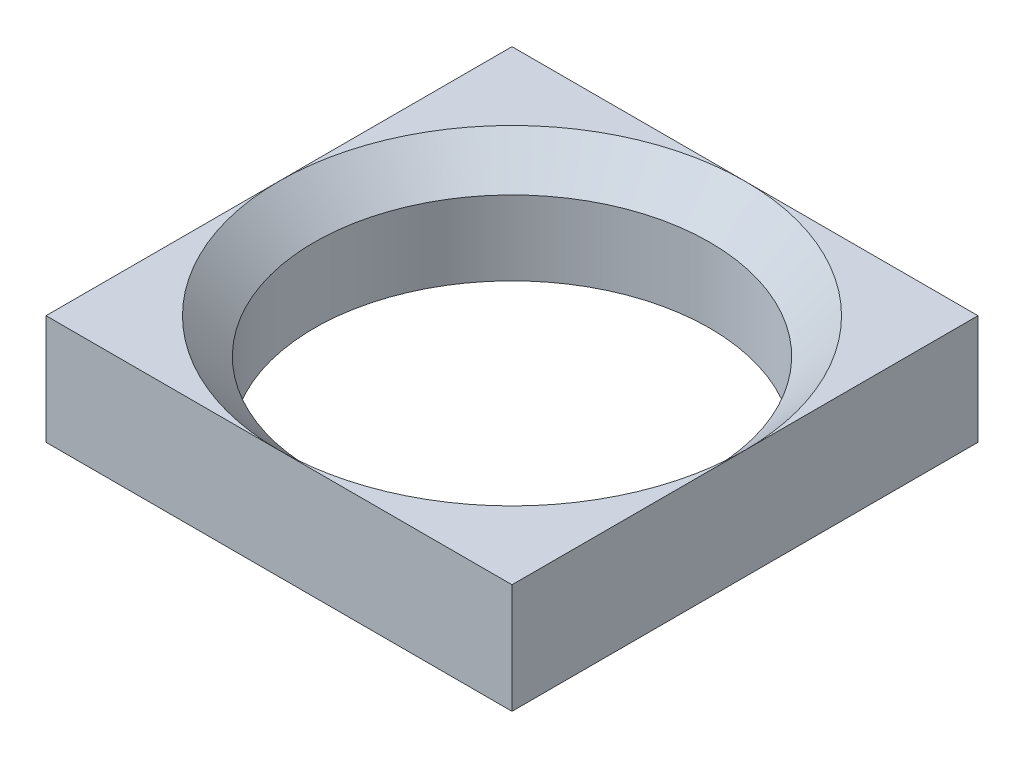
ISO-10303-21;
HEADER;
FILE_DESCRIPTION(('STEP AP214'),'2;1');
FILE_NAME('part.step','',(''),(''),'','','');
FILE_SCHEMA(('AUTOMOTIVE_DESIGN { 1 0 10303 214 1 1 1 1 }'));
ENDSEC;
DATA;
#1=APPLICATION_CONTEXT('core data for automotive mechanical design processes');
#2=APPLICATION_PROTOCOL_DEFINITION('international standard','automotive_design',2000,#1);
#3=PRODUCT_CONTEXT('',#1,'mechanical');
#4=PRODUCT('Part','Part','',(#3));
#5=PRODUCT_RELATED_PRODUCT_CATEGORY('part','',(#4));
#6=PRODUCT_DEFINITION_FORMATION('','',#4);
#7=PRODUCT_DEFINITION_CONTEXT('part definition',#1,'design');
#8=PRODUCT_DEFINITION('design','',#6,#7);
#9=PRODUCT_DEFINITION_SHAPE('','',#8);
#10=(LENGTH_UNIT() NAMED_UNIT(*) SI_UNIT(.MILLI.,.METRE.));
#11=(NAMED_UNIT(*) PLANE_ANGLE_UNIT() SI_UNIT($,.RADIAN.));
#12=(NAMED_UNIT(*) SI_UNIT($,.STERADIAN.) SOLID_ANGLE_UNIT());
#13=UNCERTAINTY_MEASURE_WITH_UNIT(LENGTH_MEASURE(1.E-05),#10,'distance_accuracy_value','');
#14=(GEOMETRIC_REPRESENTATION_CONTEXT(3) GLOBAL_UNCERTAINTY_ASSIGNED_CONTEXT((#13)) GLOBAL_UNIT_ASSIGNED_CONTEXT((#10,
#11,#12)) REPRESENTATION_CONTEXT('',''));
#15=CARTESIAN_POINT('',(0.,0.,0.));
#16=DIRECTION('',(0.,0.,1.));
#17=DIRECTION('',(1.,0.,0.));
#18=AXIS2_PLACEMENT_3D('',#15,#16,#17);
#19=CARTESIAN_POINT('',(0.,2.8,0.));
#20=DIRECTION('',(0.,1.,0.));
#21=DIRECTION('',(0.,0.,1.));
#22=AXIS2_PLACEMENT_3D('',#19,#20,#21);
#23=PLANE('',#22);
#24=DIRECTION('',(1.,0.,0.));
#25=VECTOR('',#24,1.);
#26=CARTESIAN_POINT('',(-5.95,2.8,5.95));
#27=LINE('',#26,#25);
#28=CARTESIAN_POINT('',(-5.95,2.8,5.95));
#29=VERTEX_POINT('',#28);
#30=CARTESIAN_POINT('',(0.,2.8,5.95));
#31=VERTEX_POINT('',#30);
#32=EDGE_CURVE('E142',#29,#31,#27,.T.);
#33=ORIENTED_EDGE('',*,*,#32,.T.);
#34=CARTESIAN_POINT('',(0.,2.8,0.));
#35=DIRECTION('',(0.,1.,0.));
#36=DIRECTION('',(0.,0.,1.));
#37=AXIS2_PLACEMENT_3D('',#34,#35,#36);
#38=CIRCLE('',#37,5.95000000000001);
#39=CARTESIAN_POINT('',(-5.95,2.8,0.));
#40=VERTEX_POINT('',#39);
#41=EDGE_CURVE('E11',#31,#40,#38,.F.);
#42=ORIENTED_EDGE('',*,*,#41,.T.);
#43=DIRECTION('',(0.,0.,1.));
#44=VECTOR('',#43,1.);
#45=CARTESIAN_POINT('',(-5.95,2.8,-5.95));
#46=LINE('',#45,#44);
#47=EDGE_CURVE('E116',#40,#29,#46,.T.);
#48=ORIENTED_EDGE('',*,*,#47,.T.);
#49=EDGE_LOOP('',(#33,#42,#48));
#50=FACE_BOUND('',#49,.T.);
#51=ADVANCED_FACE('F43',(#50),#23,.T.);
#52=CARTESIAN_POINT('',(-5.95,2.8,-5.95));
#53=VERTEX_POINT('',#52);
#54=EDGE_CURVE('E137',#53,#40,#46,.T.);
#55=ORIENTED_EDGE('',*,*,#54,.T.);
#56=CARTESIAN_POINT('',(0.,2.8,0.));
#57=DIRECTION('',(0.,1.,0.));
#58=DIRECTION('',(0.,0.,1.));
#59=AXIS2_PLACEMENT_3D('',#56,#57,#58);
#60=CIRCLE('',#59,5.95000000000001);
#61=CARTESIAN_POINT('',(0.,2.8,-5.95));
#62=VERTEX_POINT('',#61);
#63=EDGE_CURVE('E52',#40,#62,#60,.F.);
#64=ORIENTED_EDGE('',*,*,#63,.T.);
#65=DIRECTION('',(-1.,0.,0.));
#66=VECTOR('',#65,1.);
#67=CARTESIAN_POINT('',(-5.95,2.8,-5.95));
#68=LINE('',#67,#66);
#69=EDGE_CURVE('E115',#62,#53,#68,.T.);
#70=ORIENTED_EDGE('',*,*,#69,.T.);
#71=EDGE_LOOP('',(#55,#64,#70));
#72=FACE_BOUND('',#71,.T.);
#73=ADVANCED_FACE('F135',(#72),#23,.T.);
#74=CARTESIAN_POINT('',(5.95,2.8,-5.95));
#75=VERTEX_POINT('',#74);
#76=EDGE_CURVE('E100',#75,#62,#68,.T.);
#77=ORIENTED_EDGE('',*,*,#76,.T.);
#78=CARTESIAN_POINT('',(0.,2.8,0.));
#79=DIRECTION('',(0.,1.,0.));
#80=DIRECTION('',(0.,0.,1.));
#81=AXIS2_PLACEMENT_3D('',#78,#79,#80);
#82=CIRCLE('',#81,5.95000000000001);
#83=CARTESIAN_POINT('',(5.95,2.8,0.));
#84=VERTEX_POINT('',#83);
#85=EDGE_CURVE('E101',#62,#84,#82,.F.);
#86=ORIENTED_EDGE('',*,*,#85,.T.);
#87=DIRECTION('',(0.,0.,-1.));
#88=VECTOR('',#87,1.);
#89=CARTESIAN_POINT('',(5.95,2.8,-5.95));
#90=LINE('',#89,#88);
#91=EDGE_CURVE('E97',#84,#75,#90,.T.);
#92=ORIENTED_EDGE('',*,*,#91,.T.);
#93=EDGE_LOOP('',(#77,#86,#92));
#94=FACE_BOUND('',#93,.T.);
#95=ADVANCED_FACE('F99',(#94),#23,.T.);
#96=CARTESIAN_POINT('',(5.95,2.8,5.95));
#97=VERTEX_POINT('',#96);
#98=EDGE_CURVE('E105',#97,#84,#90,.T.);
#99=ORIENTED_EDGE('',*,*,#98,.T.);
#100=CARTESIAN_POINT('',(0.,2.8,0.));
#101=DIRECTION('',(0.,1.,0.));
#102=DIRECTION('',(0.,0.,1.));
#103=AXIS2_PLACEMENT_3D('',#100,#101,#102);
#104=CIRCLE('',#103,5.95000000000001);
#105=EDGE_CURVE('E59',#84,#31,#104,.F.);
#106=ORIENTED_EDGE('',*,*,#105,.T.);
#107=EDGE_CURVE('E140',#31,#97,#27,.T.);
#108=ORIENTED_EDGE('',*,*,#107,.T.);
#109=EDGE_LOOP('',(#99,#106,#108));
#110=FACE_BOUND('',#109,.T.);
#111=ADVANCED_FACE('F178',(#110),#23,.T.);
#112=CARTESIAN_POINT('',(0.,0.,0.));
#113=DIRECTION('',(0.,1.,0.));
#114=DIRECTION('',(0.,0.,1.));
#115=AXIS2_PLACEMENT_3D('',#112,#113,#114);
#116=PLANE('',#115);
#117=DIRECTION('',(0.,0.,-1.));
#118=VECTOR('',#117,1.);
#119=CARTESIAN_POINT('',(5.95,0.,-5.95));
#120=LINE('',#119,#118);
#121=CARTESIAN_POINT('',(5.95,0.,5.95));
#122=VERTEX_POINT('',#121);
#123=CARTESIAN_POINT('',(5.95,0.,-5.95));
#124=VERTEX_POINT('',#123);
#125=EDGE_CURVE('E121',#122,#124,#120,.T.);
#126=ORIENTED_EDGE('',*,*,#125,.F.);
#127=DIRECTION('',(1.,0.,0.));
#128=VECTOR('',#127,1.);
#129=CARTESIAN_POINT('',(-5.95,0.,5.95));
#130=LINE('',#129,#128);
#131=CARTESIAN_POINT('',(-5.95,0.,5.95));
#132=VERTEX_POINT('',#131);
#133=EDGE_CURVE('E106',#132,#122,#130,.T.);
#134=ORIENTED_EDGE('',*,*,#133,.F.);
#135=DIRECTION('',(0.,0.,1.));
#136=VECTOR('',#135,1.);
#137=CARTESIAN_POINT('',(-5.95,0.,-5.95));
#138=LINE('',#137,#136);
#139=CARTESIAN_POINT('',(-5.95,0.,-5.95));
#140=VERTEX_POINT('',#139);
#141=EDGE_CURVE('E151',#140,#132,#138,.T.);
#142=ORIENTED_EDGE('',*,*,#141,.F.);
#143=DIRECTION('',(-1.,0.,0.));
#144=VECTOR('',#143,1.);
#145=CARTESIAN_POINT('',(-5.95,0.,-5.95));
#146=LINE('',#145,#144);
#147=EDGE_CURVE('E148',#124,#140,#146,.T.);
#148=ORIENTED_EDGE('',*,*,#147,.F.);
#149=EDGE_LOOP('',(#126,#134,#142,#148));
#150=FACE_BOUND('',#149,.T.);
#151=CARTESIAN_POINT('',(0.,0.,0.));
#152=DIRECTION('',(0.,1.,0.));
#153=DIRECTION('',(0.,0.,1.));
#154=AXIS2_PLACEMENT_3D('',#151,#152,#153);
#155=CIRCLE('',#154,5.05);
#156=CARTESIAN_POINT('',(0.,0.,5.05));
#157=VERTEX_POINT('',#156);
#158=EDGE_CURVE('E149',#157,#157,#155,.T.);
#159=ORIENTED_EDGE('',*,*,#158,.T.);
#160=EDGE_LOOP('',(#159));
#161=FACE_BOUND('',#160,.T.);
#162=ADVANCED_FACE('F163',(#150,#161),#116,.F.);
#163=CARTESIAN_POINT('',(5.95,2.8,-5.95));
#164=DIRECTION('',(-1.,0.,0.));
#165=DIRECTION('',(0.,0.,1.));
#166=AXIS2_PLACEMENT_3D('',#163,#164,#165);
#167=PLANE('',#166);
#168=ORIENTED_EDGE('',*,*,#125,.T.);
#169=DIRECTION('',(0.,-1.,0.));
#170=VECTOR('',#169,1.);
#171=CARTESIAN_POINT('',(5.95,2.8,-5.95));
#172=LINE('',#171,#170);
#173=EDGE_CURVE('E112',#75,#124,#172,.T.);
#174=ORIENTED_EDGE('',*,*,#173,.F.);
#175=ORIENTED_EDGE('',*,*,#91,.F.);
#176=ORIENTED_EDGE('',*,*,#98,.F.);
#177=DIRECTION('',(0.,-1.,0.));
#178=VECTOR('',#177,1.);
#179=CARTESIAN_POINT('',(5.95,2.8,5.95));
#180=LINE('',#179,#178);
#181=EDGE_CURVE('E146',#97,#122,#180,.T.);
#182=ORIENTED_EDGE('',*,*,#181,.T.);
#183=EDGE_LOOP('',(#168,#174,#175,#176,#182));
#184=FACE_BOUND('',#183,.T.);
#185=ADVANCED_FACE('F118',(#184),#167,.F.);
#186=CARTESIAN_POINT('',(-5.95,2.8,-5.95));
#187=DIRECTION('',(0.,0.,1.));
#188=DIRECTION('',(1.,0.,0.));
#189=AXIS2_PLACEMENT_3D('',#186,#187,#188);
#190=PLANE('',#189);
#191=ORIENTED_EDGE('',*,*,#147,.T.);
#192=DIRECTION('',(0.,-1.,0.));
#193=VECTOR('',#192,1.);
#194=CARTESIAN_POINT('',(-5.95,2.8,-5.95));
#195=LINE('',#194,#193);
#196=EDGE_CURVE('E123',#53,#140,#195,.T.);
#197=ORIENTED_EDGE('',*,*,#196,.F.);
#198=ORIENTED_EDGE('',*,*,#69,.F.);
#199=ORIENTED_EDGE('',*,*,#76,.F.);
#200=ORIENTED_EDGE('',*,*,#173,.T.);
#201=EDGE_LOOP('',(#191,#197,#198,#199,#200));
#202=FACE_BOUND('',#201,.T.);
#203=ADVANCED_FACE('F111',(#202),#190,.F.);
#204=CARTESIAN_POINT('',(-5.95,2.8,-5.95));
#205=DIRECTION('',(1.,0.,0.));
#206=DIRECTION('',(0.,0.,-1.));
#207=AXIS2_PLACEMENT_3D('',#204,#205,#206);
#208=PLANE('',#207);
#209=ORIENTED_EDGE('',*,*,#141,.T.);
#210=DIRECTION('',(0.,-1.,0.));
#211=VECTOR('',#210,1.);
#212=CARTESIAN_POINT('',(-5.95,2.8,5.95));
#213=LINE('',#212,#211);
#214=EDGE_CURVE('E128',#29,#132,#213,.T.);
#215=ORIENTED_EDGE('',*,*,#214,.F.);
#216=ORIENTED_EDGE('',*,*,#47,.F.);
#217=ORIENTED_EDGE('',*,*,#54,.F.);
#218=ORIENTED_EDGE('',*,*,#196,.T.);
#219=EDGE_LOOP('',(#209,#215,#216,#217,#218));
#220=FACE_BOUND('',#219,.T.);
#221=ADVANCED_FACE('F165',(#220),#208,.F.);
#222=CARTESIAN_POINT('',(-5.95,2.8,5.95));
#223=DIRECTION('',(0.,0.,-1.));
#224=DIRECTION('',(-1.,0.,0.));
#225=AXIS2_PLACEMENT_3D('',#222,#223,#224);
#226=PLANE('',#225);
#227=ORIENTED_EDGE('',*,*,#133,.T.);
#228=ORIENTED_EDGE('',*,*,#181,.F.);
#229=ORIENTED_EDGE('',*,*,#107,.F.);
#230=ORIENTED_EDGE('',*,*,#32,.F.);
#231=ORIENTED_EDGE('',*,*,#214,.T.);
#232=EDGE_LOOP('',(#227,#228,#229,#230,#231));
#233=FACE_BOUND('',#232,.T.);
#234=ADVANCED_FACE('F159',(#233),#226,.F.);
#235=CARTESIAN_POINT('',(0.,2.8,0.));
#236=DIRECTION('',(0.,-1.,0.));
#237=DIRECTION('',(0.,0.,-1.));
#238=AXIS2_PLACEMENT_3D('',#235,#236,#237);
#239=CYLINDRICAL_SURFACE('',#238,5.05);
#240=CARTESIAN_POINT('',(0.,1.9,0.));
#241=DIRECTION('',(0.,1.,0.));
#242=DIRECTION('',(0.,0.,1.));
#243=AXIS2_PLACEMENT_3D('',#240,#241,#242);
#244=CIRCLE('',#243,5.05);
#245=CARTESIAN_POINT('',(0.,1.9,5.05));
#246=VERTEX_POINT('',#245);
#247=EDGE_CURVE('E122',#246,#246,#244,.T.);
#248=ORIENTED_EDGE('',*,*,#247,.T.);
#249=EDGE_LOOP('',(#248));
#250=FACE_BOUND('',#249,.T.);
#251=ORIENTED_EDGE('',*,*,#158,.F.);
#252=EDGE_LOOP('',(#251));
#253=FACE_BOUND('',#252,.T.);
#254=ADVANCED_FACE('F172',(#250,#253),#239,.F.);
#255=CARTESIAN_POINT('',(0.,1.9,0.));
#256=DIRECTION('',(0.,1.,0.));
#257=DIRECTION('',(0.,0.,1.));
#258=AXIS2_PLACEMENT_3D('',#255,#256,#257);
#259=CONICAL_SURFACE('',#258,5.05,0.785398163397449);
#260=ORIENTED_EDGE('',*,*,#63,.F.);
#261=ORIENTED_EDGE('',*,*,#41,.F.);
#262=ORIENTED_EDGE('',*,*,#105,.F.);
#263=ORIENTED_EDGE('',*,*,#85,.F.);
#264=EDGE_LOOP('',(#260,#261,#262,#263));
#265=FACE_BOUND('',#264,.T.);
#266=ORIENTED_EDGE('',*,*,#247,.F.);
#267=EDGE_LOOP('',(#266));
#268=FACE_BOUND('',#267,.T.);
#269=ADVANCED_FACE('F46',(#265,#268),#259,.F.);
#270=CLOSED_SHELL('',(#51,#73,#95,#111,#162,#185,#203,#221,#234,#254,#269));
#271=MANIFOLD_SOLID_BREP('B2',#270);
#272=ADVANCED_BREP_SHAPE_REPRESENTATION('',(#18,#271),#14);
#273=SHAPE_DEFINITION_REPRESENTATION(#9,#272);
ENDSEC;
END-ISO-10303-21;
